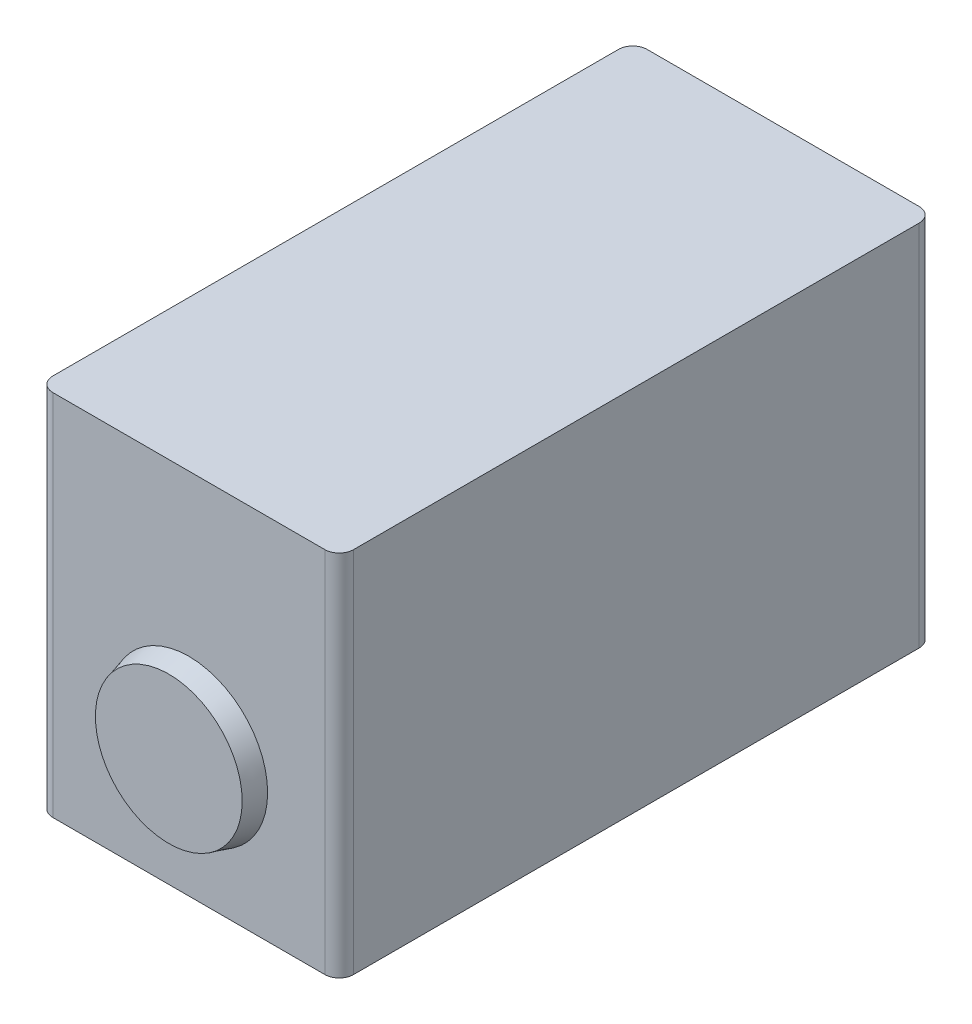
ISO-10303-21;
HEADER;
FILE_DESCRIPTION(('STEP AP214'),'2;1');
FILE_NAME('part.step','',(''),(''),'','','');
FILE_SCHEMA(('AUTOMOTIVE_DESIGN { 1 0 10303 214 1 1 1 1 }'));
ENDSEC;
DATA;
#1=APPLICATION_CONTEXT('core data for automotive mechanical design processes');
#2=APPLICATION_PROTOCOL_DEFINITION('international standard','automotive_design',2000,#1);
#3=PRODUCT_CONTEXT('',#1,'mechanical');
#4=PRODUCT('Part','Part','',(#3));
#5=PRODUCT_RELATED_PRODUCT_CATEGORY('part','',(#4));
#6=PRODUCT_DEFINITION_FORMATION('','',#4);
#7=PRODUCT_DEFINITION_CONTEXT('part definition',#1,'design');
#8=PRODUCT_DEFINITION('design','',#6,#7);
#9=PRODUCT_DEFINITION_SHAPE('','',#8);
#10=(LENGTH_UNIT() NAMED_UNIT(*) SI_UNIT(.MILLI.,.METRE.));
#11=(NAMED_UNIT(*) PLANE_ANGLE_UNIT() SI_UNIT($,.RADIAN.));
#12=(NAMED_UNIT(*) SI_UNIT($,.STERADIAN.) SOLID_ANGLE_UNIT());
#13=UNCERTAINTY_MEASURE_WITH_UNIT(LENGTH_MEASURE(1.E-05),#10,'distance_accuracy_value','');
#14=(GEOMETRIC_REPRESENTATION_CONTEXT(3) GLOBAL_UNCERTAINTY_ASSIGNED_CONTEXT((#13)) GLOBAL_UNIT_ASSIGNED_CONTEXT((#10,
#11,#12)) REPRESENTATION_CONTEXT('',''));
#15=CARTESIAN_POINT('',(0.,0.,0.));
#16=DIRECTION('',(0.,0.,1.));
#17=DIRECTION('',(1.,0.,0.));
#18=AXIS2_PLACEMENT_3D('',#15,#16,#17);
#19=CARTESIAN_POINT('',(10.5,25.7,20.75));
#20=DIRECTION('',(0.,0.,-1.));
#21=DIRECTION('',(-1.,0.,0.));
#22=AXIS2_PLACEMENT_3D('',#19,#20,#21);
#23=PLANE('',#22);
#24=DIRECTION('',(1.,0.,0.));
#25=VECTOR('',#24,1.);
#26=CARTESIAN_POINT('',(10.5,25.7,20.75));
#27=LINE('',#26,#25);
#28=CARTESIAN_POINT('',(-9.5,25.7,20.75));
#29=VERTEX_POINT('',#28);
#30=CARTESIAN_POINT('',(9.5,25.7,20.75));
#31=VERTEX_POINT('',#30);
#32=EDGE_CURVE('E172',#29,#31,#27,.T.);
#33=ORIENTED_EDGE('',*,*,#32,.F.);
#34=DIRECTION('',(0.,-1.,0.));
#35=VECTOR('',#34,1.);
#36=CARTESIAN_POINT('',(-9.50000000000001,25.7,20.75));
#37=LINE('',#36,#35);
#38=CARTESIAN_POINT('',(-9.5,0.,20.75));
#39=VERTEX_POINT('',#38);
#40=EDGE_CURVE('E46',#29,#39,#37,.T.);
#41=ORIENTED_EDGE('',*,*,#40,.T.);
#42=DIRECTION('',(1.,0.,0.));
#43=VECTOR('',#42,1.);
#44=CARTESIAN_POINT('',(10.5,0.,20.75));
#45=LINE('',#44,#43);
#46=CARTESIAN_POINT('',(9.5,0.,20.75));
#47=VERTEX_POINT('',#46);
#48=EDGE_CURVE('E132',#39,#47,#45,.T.);
#49=ORIENTED_EDGE('',*,*,#48,.T.);
#50=DIRECTION('',(0.,-1.,0.));
#51=VECTOR('',#50,1.);
#52=CARTESIAN_POINT('',(9.5,25.7,20.75));
#53=LINE('',#52,#51);
#54=EDGE_CURVE('E165',#47,#31,#53,.F.);
#55=ORIENTED_EDGE('',*,*,#54,.T.);
#56=EDGE_LOOP('',(#33,#41,#49,#55));
#57=FACE_BOUND('',#56,.T.);
#58=CARTESIAN_POINT('',(0.,9.,20.75));
#59=DIRECTION('',(0.,0.,-1.));
#60=DIRECTION('',(-1.,0.,0.));
#61=AXIS2_PLACEMENT_3D('',#58,#59,#60);
#62=CIRCLE('',#61,5.5);
#63=CARTESIAN_POINT('',(-5.5,9.,20.75));
#64=VERTEX_POINT('',#63);
#65=EDGE_CURVE('E11',#64,#64,#62,.F.);
#66=ORIENTED_EDGE('',*,*,#65,.F.);
#67=EDGE_LOOP('',(#66));
#68=FACE_BOUND('',#67,.T.);
#69=ADVANCED_FACE('F38',(#57,#68),#23,.F.);
#70=CARTESIAN_POINT('',(-10.5,25.7,20.75));
#71=DIRECTION('',(1.,0.,0.));
#72=DIRECTION('',(0.,0.,-1.));
#73=AXIS2_PLACEMENT_3D('',#70,#71,#72);
#74=PLANE('',#73);
#75=DIRECTION('',(0.,0.,1.));
#76=VECTOR('',#75,1.);
#77=CARTESIAN_POINT('',(-10.5,25.7,20.75));
#78=LINE('',#77,#76);
#79=CARTESIAN_POINT('',(-10.5,25.7,-19.75));
#80=VERTEX_POINT('',#79);
#81=CARTESIAN_POINT('',(-10.5,25.7,19.75));
#82=VERTEX_POINT('',#81);
#83=EDGE_CURVE('E125',#80,#82,#78,.T.);
#84=ORIENTED_EDGE('',*,*,#83,.F.);
#85=DIRECTION('',(0.,-1.,0.));
#86=VECTOR('',#85,1.);
#87=CARTESIAN_POINT('',(-10.5,25.7,-19.75));
#88=LINE('',#87,#86);
#89=CARTESIAN_POINT('',(-10.5,0.,-19.75));
#90=VERTEX_POINT('',#89);
#91=EDGE_CURVE('E109',#80,#90,#88,.T.);
#92=ORIENTED_EDGE('',*,*,#91,.T.);
#93=DIRECTION('',(0.,0.,1.));
#94=VECTOR('',#93,1.);
#95=CARTESIAN_POINT('',(-10.5,0.,20.75));
#96=LINE('',#95,#94);
#97=CARTESIAN_POINT('',(-10.5,0.,19.75));
#98=VERTEX_POINT('',#97);
#99=EDGE_CURVE('E122',#90,#98,#96,.T.);
#100=ORIENTED_EDGE('',*,*,#99,.T.);
#101=DIRECTION('',(0.,-1.,0.));
#102=VECTOR('',#101,1.);
#103=CARTESIAN_POINT('',(-10.5,25.7,19.75));
#104=LINE('',#103,#102);
#105=EDGE_CURVE('E127',#98,#82,#104,.F.);
#106=ORIENTED_EDGE('',*,*,#105,.T.);
#107=EDGE_LOOP('',(#84,#92,#100,#106));
#108=FACE_BOUND('',#107,.T.);
#109=ADVANCED_FACE('F121',(#108),#74,.F.);
#110=CARTESIAN_POINT('',(10.5,25.7,20.75));
#111=DIRECTION('',(-1.,0.,0.));
#112=DIRECTION('',(0.,0.,1.));
#113=AXIS2_PLACEMENT_3D('',#110,#111,#112);
#114=PLANE('',#113);
#115=DIRECTION('',(0.,0.,-1.));
#116=VECTOR('',#115,1.);
#117=CARTESIAN_POINT('',(10.5,0.,20.75));
#118=LINE('',#117,#116);
#119=CARTESIAN_POINT('',(10.5,0.,19.75));
#120=VERTEX_POINT('',#119);
#121=CARTESIAN_POINT('',(10.5,0.,-19.75));
#122=VERTEX_POINT('',#121);
#123=EDGE_CURVE('E136',#120,#122,#118,.T.);
#124=ORIENTED_EDGE('',*,*,#123,.T.);
#125=DIRECTION('',(0.,-1.,0.));
#126=VECTOR('',#125,1.);
#127=CARTESIAN_POINT('',(10.5,25.7,-19.75));
#128=LINE('',#127,#126);
#129=CARTESIAN_POINT('',(10.5,25.7,-19.75));
#130=VERTEX_POINT('',#129);
#131=EDGE_CURVE('E53',#122,#130,#128,.F.);
#132=ORIENTED_EDGE('',*,*,#131,.T.);
#133=DIRECTION('',(0.,0.,-1.));
#134=VECTOR('',#133,1.);
#135=CARTESIAN_POINT('',(10.5,25.7,20.75));
#136=LINE('',#135,#134);
#137=CARTESIAN_POINT('',(10.5,25.7,19.75));
#138=VERTEX_POINT('',#137);
#139=EDGE_CURVE('E179',#138,#130,#136,.T.);
#140=ORIENTED_EDGE('',*,*,#139,.F.);
#141=DIRECTION('',(0.,-1.,0.));
#142=VECTOR('',#141,1.);
#143=CARTESIAN_POINT('',(10.5,25.7,19.75));
#144=LINE('',#143,#142);
#145=EDGE_CURVE('E161',#138,#120,#144,.T.);
#146=ORIENTED_EDGE('',*,*,#145,.T.);
#147=EDGE_LOOP('',(#124,#132,#140,#146));
#148=FACE_BOUND('',#147,.T.);
#149=ADVANCED_FACE('F178',(#148),#114,.F.);
#150=CARTESIAN_POINT('',(10.5,25.7,-20.75));
#151=DIRECTION('',(0.,0.,1.));
#152=DIRECTION('',(1.,0.,0.));
#153=AXIS2_PLACEMENT_3D('',#150,#151,#152);
#154=PLANE('',#153);
#155=DIRECTION('',(-1.,0.,0.));
#156=VECTOR('',#155,1.);
#157=CARTESIAN_POINT('',(10.5,0.,-20.75));
#158=LINE('',#157,#156);
#159=CARTESIAN_POINT('',(9.5,0.,-20.75));
#160=VERTEX_POINT('',#159);
#161=CARTESIAN_POINT('',(-9.5,0.,-20.75));
#162=VERTEX_POINT('',#161);
#163=EDGE_CURVE('E145',#160,#162,#158,.T.);
#164=ORIENTED_EDGE('',*,*,#163,.T.);
#165=DIRECTION('',(0.,-1.,0.));
#166=VECTOR('',#165,1.);
#167=CARTESIAN_POINT('',(-9.50000000000001,25.7,-20.75));
#168=LINE('',#167,#166);
#169=CARTESIAN_POINT('',(-9.5,25.7,-20.75));
#170=VERTEX_POINT('',#169);
#171=EDGE_CURVE('E110',#162,#170,#168,.F.);
#172=ORIENTED_EDGE('',*,*,#171,.T.);
#173=DIRECTION('',(-1.,0.,0.));
#174=VECTOR('',#173,1.);
#175=CARTESIAN_POINT('',(10.5,25.7,-20.75));
#176=LINE('',#175,#174);
#177=CARTESIAN_POINT('',(9.5,25.7,-20.75));
#178=VERTEX_POINT('',#177);
#179=EDGE_CURVE('E141',#178,#170,#176,.T.);
#180=ORIENTED_EDGE('',*,*,#179,.F.);
#181=DIRECTION('',(0.,-1.,0.));
#182=VECTOR('',#181,1.);
#183=CARTESIAN_POINT('',(9.5,25.7,-20.75));
#184=LINE('',#183,#182);
#185=EDGE_CURVE('E115',#178,#160,#184,.T.);
#186=ORIENTED_EDGE('',*,*,#185,.T.);
#187=EDGE_LOOP('',(#164,#172,#180,#186));
#188=FACE_BOUND('',#187,.T.);
#189=ADVANCED_FACE('F212',(#188),#154,.F.);
#190=CARTESIAN_POINT('',(-10.5,25.7,-20.75));
#191=DIRECTION('',(0.,1.,0.));
#192=DIRECTION('',(0.,0.,1.));
#193=AXIS2_PLACEMENT_3D('',#190,#191,#192);
#194=PLANE('',#193);
#195=ORIENTED_EDGE('',*,*,#179,.T.);
#196=CARTESIAN_POINT('',(-9.5,25.7,-19.75));
#197=DIRECTION('',(0.,1.,0.));
#198=DIRECTION('',(0.,0.,1.));
#199=AXIS2_PLACEMENT_3D('',#196,#197,#198);
#200=CIRCLE('',#199,1.);
#201=EDGE_CURVE('E159',#170,#80,#200,.T.);
#202=ORIENTED_EDGE('',*,*,#201,.T.);
#203=ORIENTED_EDGE('',*,*,#83,.T.);
#204=CARTESIAN_POINT('',(-9.50000000000001,25.7,19.75));
#205=DIRECTION('',(0.,1.,0.));
#206=DIRECTION('',(0.,0.,1.));
#207=AXIS2_PLACEMENT_3D('',#204,#205,#206);
#208=CIRCLE('',#207,1.);
#209=EDGE_CURVE('E155',#82,#29,#208,.T.);
#210=ORIENTED_EDGE('',*,*,#209,.T.);
#211=ORIENTED_EDGE('',*,*,#32,.T.);
#212=CARTESIAN_POINT('',(9.5,25.7,19.75));
#213=DIRECTION('',(0.,1.,0.));
#214=DIRECTION('',(0.,0.,1.));
#215=AXIS2_PLACEMENT_3D('',#212,#213,#214);
#216=CIRCLE('',#215,1.);
#217=EDGE_CURVE('E60',#31,#138,#216,.T.);
#218=ORIENTED_EDGE('',*,*,#217,.T.);
#219=ORIENTED_EDGE('',*,*,#139,.T.);
#220=CARTESIAN_POINT('',(9.5,25.7,-19.75));
#221=DIRECTION('',(0.,1.,0.));
#222=DIRECTION('',(0.,0.,1.));
#223=AXIS2_PLACEMENT_3D('',#220,#221,#222);
#224=CIRCLE('',#223,1.);
#225=EDGE_CURVE('E157',#130,#178,#224,.T.);
#226=ORIENTED_EDGE('',*,*,#225,.T.);
#227=EDGE_LOOP('',(#195,#202,#203,#210,#211,#218,#219,#226));
#228=FACE_BOUND('',#227,.T.);
#229=ADVANCED_FACE('F184',(#228),#194,.T.);
#230=CARTESIAN_POINT('',(-10.5,0.,-20.75));
#231=DIRECTION('',(0.,1.,0.));
#232=DIRECTION('',(0.,0.,1.));
#233=AXIS2_PLACEMENT_3D('',#230,#231,#232);
#234=PLANE('',#233);
#235=ORIENTED_EDGE('',*,*,#99,.F.);
#236=CARTESIAN_POINT('',(-9.5,0.,-19.75));
#237=DIRECTION('',(0.,1.,0.));
#238=DIRECTION('',(0.,0.,1.));
#239=AXIS2_PLACEMENT_3D('',#236,#237,#238);
#240=CIRCLE('',#239,1.);
#241=EDGE_CURVE('E105',#90,#162,#240,.F.);
#242=ORIENTED_EDGE('',*,*,#241,.T.);
#243=ORIENTED_EDGE('',*,*,#163,.F.);
#244=CARTESIAN_POINT('',(9.5,0.,-19.75));
#245=DIRECTION('',(0.,1.,0.));
#246=DIRECTION('',(0.,0.,1.));
#247=AXIS2_PLACEMENT_3D('',#244,#245,#246);
#248=CIRCLE('',#247,1.);
#249=EDGE_CURVE('E116',#160,#122,#248,.F.);
#250=ORIENTED_EDGE('',*,*,#249,.T.);
#251=ORIENTED_EDGE('',*,*,#123,.F.);
#252=CARTESIAN_POINT('',(9.5,0.,19.75));
#253=DIRECTION('',(0.,1.,0.));
#254=DIRECTION('',(0.,0.,1.));
#255=AXIS2_PLACEMENT_3D('',#252,#253,#254);
#256=CIRCLE('',#255,1.);
#257=EDGE_CURVE('E126',#120,#47,#256,.F.);
#258=ORIENTED_EDGE('',*,*,#257,.T.);
#259=ORIENTED_EDGE('',*,*,#48,.F.);
#260=CARTESIAN_POINT('',(-9.50000000000001,0.,19.75));
#261=DIRECTION('',(0.,1.,0.));
#262=DIRECTION('',(0.,0.,1.));
#263=AXIS2_PLACEMENT_3D('',#260,#261,#262);
#264=CIRCLE('',#263,1.);
#265=EDGE_CURVE('E131',#39,#98,#264,.F.);
#266=ORIENTED_EDGE('',*,*,#265,.T.);
#267=EDGE_LOOP('',(#235,#242,#243,#250,#251,#258,#259,#266));
#268=FACE_BOUND('',#267,.T.);
#269=ADVANCED_FACE('F129',(#268),#234,.F.);
#270=CARTESIAN_POINT('',(-9.5,25.7,-19.75));
#271=DIRECTION('',(0.,-1.,0.));
#272=DIRECTION('',(0.,0.,-1.));
#273=AXIS2_PLACEMENT_3D('',#270,#271,#272);
#274=CYLINDRICAL_SURFACE('',#273,1.);
#275=ORIENTED_EDGE('',*,*,#201,.F.);
#276=ORIENTED_EDGE('',*,*,#171,.F.);
#277=ORIENTED_EDGE('',*,*,#241,.F.);
#278=ORIENTED_EDGE('',*,*,#91,.F.);
#279=EDGE_LOOP('',(#275,#276,#277,#278));
#280=FACE_BOUND('',#279,.T.);
#281=ADVANCED_FACE('F108',(#280),#274,.T.);
#282=CARTESIAN_POINT('',(9.5,25.7,-19.75));
#283=DIRECTION('',(0.,-1.,0.));
#284=DIRECTION('',(0.,0.,-1.));
#285=AXIS2_PLACEMENT_3D('',#282,#283,#284);
#286=CYLINDRICAL_SURFACE('',#285,1.);
#287=ORIENTED_EDGE('',*,*,#225,.F.);
#288=ORIENTED_EDGE('',*,*,#131,.F.);
#289=ORIENTED_EDGE('',*,*,#249,.F.);
#290=ORIENTED_EDGE('',*,*,#185,.F.);
#291=EDGE_LOOP('',(#287,#288,#289,#290));
#292=FACE_BOUND('',#291,.T.);
#293=ADVANCED_FACE('F187',(#292),#286,.T.);
#294=CARTESIAN_POINT('',(-9.50000000000001,25.7,19.75));
#295=DIRECTION('',(0.,-1.,0.));
#296=DIRECTION('',(0.,0.,-1.));
#297=AXIS2_PLACEMENT_3D('',#294,#295,#296);
#298=CYLINDRICAL_SURFACE('',#297,1.);
#299=ORIENTED_EDGE('',*,*,#209,.F.);
#300=ORIENTED_EDGE('',*,*,#105,.F.);
#301=ORIENTED_EDGE('',*,*,#265,.F.);
#302=ORIENTED_EDGE('',*,*,#40,.F.);
#303=EDGE_LOOP('',(#299,#300,#301,#302));
#304=FACE_BOUND('',#303,.T.);
#305=ADVANCED_FACE('F185',(#304),#298,.T.);
#306=CARTESIAN_POINT('',(9.5,25.7,19.75));
#307=DIRECTION('',(0.,-1.,0.));
#308=DIRECTION('',(0.,0.,-1.));
#309=AXIS2_PLACEMENT_3D('',#306,#307,#308);
#310=CYLINDRICAL_SURFACE('',#309,1.);
#311=ORIENTED_EDGE('',*,*,#217,.F.);
#312=ORIENTED_EDGE('',*,*,#54,.F.);
#313=ORIENTED_EDGE('',*,*,#257,.F.);
#314=ORIENTED_EDGE('',*,*,#145,.F.);
#315=EDGE_LOOP('',(#311,#312,#313,#314));
#316=FACE_BOUND('',#315,.T.);
#317=ADVANCED_FACE('F40',(#316),#310,.T.);
#318=CARTESIAN_POINT('',(0.,9.,20.75));
#319=DIRECTION('',(0.,0.,-1.));
#320=DIRECTION('',(1.,0.,0.));
#321=AXIS2_PLACEMENT_3D('',#318,#319,#320);
#322=CONICAL_SURFACE('',#321,5.5,0.26179938779915);
#323=CARTESIAN_POINT('',(0.,9.,22.15));
#324=DIRECTION('',(0.,0.,1.));
#325=DIRECTION('',(1.,0.,0.));
#326=AXIS2_PLACEMENT_3D('',#323,#324,#325);
#327=CIRCLE('',#326,5.12487113059643);
#328=CARTESIAN_POINT('',(5.12487113059643,9.,22.15));
#329=VERTEX_POINT('',#328);
#330=EDGE_CURVE('E133',#329,#329,#327,.T.);
#331=ORIENTED_EDGE('',*,*,#330,.F.);
#332=EDGE_LOOP('',(#331));
#333=FACE_BOUND('',#332,.T.);
#334=ORIENTED_EDGE('',*,*,#65,.T.);
#335=EDGE_LOOP('',(#334));
#336=FACE_BOUND('',#335,.T.);
#337=ADVANCED_FACE('F192',(#333,#336),#322,.T.);
#338=CARTESIAN_POINT('',(0.,9.,22.15));
#339=DIRECTION('',(0.,0.,1.));
#340=DIRECTION('',(1.,0.,0.));
#341=AXIS2_PLACEMENT_3D('',#338,#339,#340);
#342=PLANE('',#341);
#343=ORIENTED_EDGE('',*,*,#330,.T.);
#344=EDGE_LOOP('',(#343));
#345=FACE_BOUND('',#344,.T.);
#346=ADVANCED_FACE('F275',(#345),#342,.T.);
#347=CLOSED_SHELL('',(#69,#109,#149,#189,#229,#269,#281,#293,#305,#317,#337,#346));
#348=MANIFOLD_SOLID_BREP('B2',#347);
#349=ADVANCED_BREP_SHAPE_REPRESENTATION('',(#18,#348),#14);
#350=SHAPE_DEFINITION_REPRESENTATION(#9,#349);
ENDSEC;
END-ISO-10303-21;
